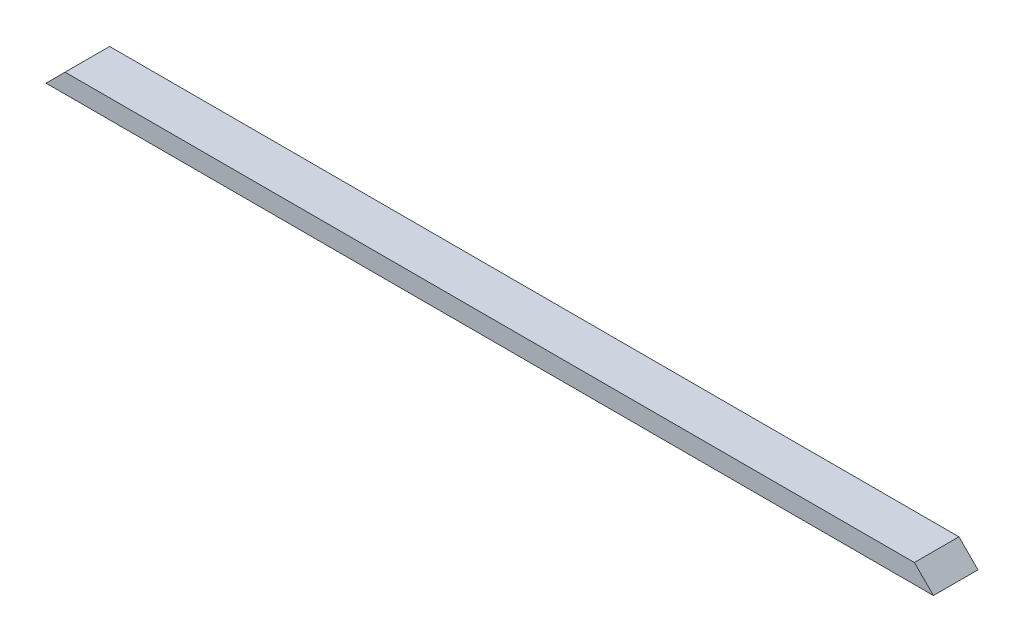
ISO-10303-21;
HEADER;
FILE_DESCRIPTION(('STEP AP214'),'2;1');
FILE_NAME('part.step','',(''),(''),'','','');
FILE_SCHEMA(('AUTOMOTIVE_DESIGN { 1 0 10303 214 1 1 1 1 }'));
ENDSEC;
DATA;
#1=APPLICATION_CONTEXT('core data for automotive mechanical design processes');
#2=APPLICATION_PROTOCOL_DEFINITION('international standard','automotive_design',2000,#1);
#3=PRODUCT_CONTEXT('',#1,'mechanical');
#4=PRODUCT('Part','Part','',(#3));
#5=PRODUCT_RELATED_PRODUCT_CATEGORY('part','',(#4));
#6=PRODUCT_DEFINITION_FORMATION('','',#4);
#7=PRODUCT_DEFINITION_CONTEXT('part definition',#1,'design');
#8=PRODUCT_DEFINITION('design','',#6,#7);
#9=PRODUCT_DEFINITION_SHAPE('','',#8);
#10=(LENGTH_UNIT() NAMED_UNIT(*) SI_UNIT(.MILLI.,.METRE.));
#11=(NAMED_UNIT(*) PLANE_ANGLE_UNIT() SI_UNIT($,.RADIAN.));
#12=(NAMED_UNIT(*) SI_UNIT($,.STERADIAN.) SOLID_ANGLE_UNIT());
#13=UNCERTAINTY_MEASURE_WITH_UNIT(LENGTH_MEASURE(1.E-05),#10,'distance_accuracy_value','');
#14=(GEOMETRIC_REPRESENTATION_CONTEXT(3) GLOBAL_UNCERTAINTY_ASSIGNED_CONTEXT((#13)) GLOBAL_UNIT_ASSIGNED_CONTEXT((#10,
#11,#12)) REPRESENTATION_CONTEXT('',''));
#15=CARTESIAN_POINT('',(0.,0.,0.));
#16=DIRECTION('',(0.,0.,1.));
#17=DIRECTION('',(1.,0.,0.));
#18=AXIS2_PLACEMENT_3D('',#15,#16,#17);
#19=CARTESIAN_POINT('',(0.,38.1,0.));
#20=DIRECTION('',(0.,0.,-1.));
#21=DIRECTION('',(-1.,0.,0.));
#22=AXIS2_PLACEMENT_3D('',#19,#20,#21);
#23=PLANE('',#22);
#24=DIRECTION('',(1.,0.,0.));
#25=VECTOR('',#24,1.);
#26=CARTESIAN_POINT('',(0.,38.1,0.));
#27=LINE('',#26,#25);
#28=CARTESIAN_POINT('',(38.1,38.1,0.));
#29=VERTEX_POINT('',#28);
#30=CARTESIAN_POINT('',(1733.55,38.1000000000001,0.));
#31=VERTEX_POINT('',#30);
#32=EDGE_CURVE('E46',#29,#31,#27,.T.);
#33=ORIENTED_EDGE('',*,*,#32,.F.);
#34=DIRECTION('',(0.707106781186547,0.707106781186547,0.));
#35=VECTOR('',#34,1.);
#36=CARTESIAN_POINT('',(0.,0.,0.));
#37=LINE('',#36,#35);
#38=CARTESIAN_POINT('',(0.,0.,0.));
#39=VERTEX_POINT('',#38);
#40=EDGE_CURVE('E81',#39,#29,#37,.T.);
#41=ORIENTED_EDGE('',*,*,#40,.F.);
#42=DIRECTION('',(1.,0.,0.));
#43=VECTOR('',#42,1.);
#44=CARTESIAN_POINT('',(0.,0.,0.));
#45=LINE('',#44,#43);
#46=CARTESIAN_POINT('',(1771.65,0.,0.));
#47=VERTEX_POINT('',#46);
#48=EDGE_CURVE('E86',#39,#47,#45,.T.);
#49=ORIENTED_EDGE('',*,*,#48,.T.);
#50=DIRECTION('',(0.707106781186547,-0.707106781186548,0.));
#51=VECTOR('',#50,1.);
#52=CARTESIAN_POINT('',(1733.55,38.1000000000001,0.));
#53=LINE('',#52,#51);
#54=EDGE_CURVE('E62',#31,#47,#53,.T.);
#55=ORIENTED_EDGE('',*,*,#54,.F.);
#56=EDGE_LOOP('',(#33,#41,#49,#55));
#57=FACE_BOUND('',#56,.T.);
#58=ADVANCED_FACE('F38',(#57),#23,.F.);
#59=CARTESIAN_POINT('',(0.,38.1,-88.9));
#60=DIRECTION('',(0.,0.,1.));
#61=DIRECTION('',(1.,0.,0.));
#62=AXIS2_PLACEMENT_3D('',#59,#60,#61);
#63=PLANE('',#62);
#64=DIRECTION('',(-1.,0.,0.));
#65=VECTOR('',#64,1.);
#66=CARTESIAN_POINT('',(0.,0.,-88.9));
#67=LINE('',#66,#65);
#68=CARTESIAN_POINT('',(1771.65,0.,-88.9));
#69=VERTEX_POINT('',#68);
#70=CARTESIAN_POINT('',(0.,0.,-88.9));
#71=VERTEX_POINT('',#70);
#72=EDGE_CURVE('E41',#69,#71,#67,.T.);
#73=ORIENTED_EDGE('',*,*,#72,.T.);
#74=DIRECTION('',(0.707106781186547,0.707106781186547,0.));
#75=VECTOR('',#74,1.);
#76=CARTESIAN_POINT('',(0.,0.,-88.9));
#77=LINE('',#76,#75);
#78=CARTESIAN_POINT('',(38.1,38.1,-88.9));
#79=VERTEX_POINT('',#78);
#80=EDGE_CURVE('E54',#71,#79,#77,.T.);
#81=ORIENTED_EDGE('',*,*,#80,.T.);
#82=DIRECTION('',(-1.,0.,0.));
#83=VECTOR('',#82,1.);
#84=CARTESIAN_POINT('',(0.,38.1,-88.9));
#85=LINE('',#84,#83);
#86=CARTESIAN_POINT('',(1733.55,38.1000000000001,-88.9));
#87=VERTEX_POINT('',#86);
#88=EDGE_CURVE('E11',#87,#79,#85,.T.);
#89=ORIENTED_EDGE('',*,*,#88,.F.);
#90=DIRECTION('',(0.707106781186547,-0.707106781186548,0.));
#91=VECTOR('',#90,1.);
#92=CARTESIAN_POINT('',(1733.55,38.1000000000001,-88.9));
#93=LINE('',#92,#91);
#94=EDGE_CURVE('E99',#87,#69,#93,.T.);
#95=ORIENTED_EDGE('',*,*,#94,.T.);
#96=EDGE_LOOP('',(#73,#81,#89,#95));
#97=FACE_BOUND('',#96,.T.);
#98=ADVANCED_FACE('F108',(#97),#63,.F.);
#99=CARTESIAN_POINT('',(0.,38.1,0.));
#100=DIRECTION('',(0.,-1.,0.));
#101=DIRECTION('',(0.,0.,-1.));
#102=AXIS2_PLACEMENT_3D('',#99,#100,#101);
#103=PLANE('',#102);
#104=ORIENTED_EDGE('',*,*,#88,.T.);
#105=DIRECTION('',(0.,0.,1.));
#106=VECTOR('',#105,1.);
#107=CARTESIAN_POINT('',(38.1,38.1,-88.9));
#108=LINE('',#107,#106);
#109=EDGE_CURVE('E87',#79,#29,#108,.T.);
#110=ORIENTED_EDGE('',*,*,#109,.T.);
#111=ORIENTED_EDGE('',*,*,#32,.T.);
#112=DIRECTION('',(0.,0.,1.));
#113=VECTOR('',#112,1.);
#114=CARTESIAN_POINT('',(1733.55,38.1000000000001,-88.9));
#115=LINE('',#114,#113);
#116=EDGE_CURVE('E102',#87,#31,#115,.T.);
#117=ORIENTED_EDGE('',*,*,#116,.F.);
#118=EDGE_LOOP('',(#104,#110,#111,#117));
#119=FACE_BOUND('',#118,.T.);
#120=ADVANCED_FACE('F111',(#119),#103,.F.);
#121=CARTESIAN_POINT('',(0.,0.,0.));
#122=DIRECTION('',(0.,-1.,0.));
#123=DIRECTION('',(0.,0.,-1.));
#124=AXIS2_PLACEMENT_3D('',#121,#122,#123);
#125=PLANE('',#124);
#126=DIRECTION('',(0.,0.,1.));
#127=VECTOR('',#126,1.);
#128=CARTESIAN_POINT('',(0.,0.,0.));
#129=LINE('',#128,#127);
#130=EDGE_CURVE('E78',#71,#39,#129,.T.);
#131=ORIENTED_EDGE('',*,*,#130,.F.);
#132=ORIENTED_EDGE('',*,*,#72,.F.);
#133=DIRECTION('',(0.,0.,-1.));
#134=VECTOR('',#133,1.);
#135=CARTESIAN_POINT('',(1771.65,0.,0.));
#136=LINE('',#135,#134);
#137=EDGE_CURVE('E95',#47,#69,#136,.T.);
#138=ORIENTED_EDGE('',*,*,#137,.F.);
#139=ORIENTED_EDGE('',*,*,#48,.F.);
#140=EDGE_LOOP('',(#131,#132,#138,#139));
#141=FACE_BOUND('',#140,.T.);
#142=ADVANCED_FACE('F94',(#141),#125,.T.);
#143=CARTESIAN_POINT('',(1733.55,38.1000000000001,-88.9));
#144=DIRECTION('',(-0.707106781186548,-0.707106781186547,0.));
#145=DIRECTION('',(0.707106781186547,-0.707106781186548,0.));
#146=AXIS2_PLACEMENT_3D('',#143,#144,#145);
#147=PLANE('',#146);
#148=ORIENTED_EDGE('',*,*,#54,.T.);
#149=ORIENTED_EDGE('',*,*,#137,.T.);
#150=ORIENTED_EDGE('',*,*,#94,.F.);
#151=ORIENTED_EDGE('',*,*,#116,.T.);
#152=EDGE_LOOP('',(#148,#149,#150,#151));
#153=FACE_BOUND('',#152,.T.);
#154=ADVANCED_FACE('F112',(#153),#147,.F.);
#155=CARTESIAN_POINT('',(0.,0.,-88.9));
#156=DIRECTION('',(0.707106781186547,-0.707106781186547,0.));
#157=DIRECTION('',(0.707106781186548,0.707106781186548,0.));
#158=AXIS2_PLACEMENT_3D('',#155,#156,#157);
#159=PLANE('',#158);
#160=ORIENTED_EDGE('',*,*,#40,.T.);
#161=ORIENTED_EDGE('',*,*,#109,.F.);
#162=ORIENTED_EDGE('',*,*,#80,.F.);
#163=ORIENTED_EDGE('',*,*,#130,.T.);
#164=EDGE_LOOP('',(#160,#161,#162,#163));
#165=FACE_BOUND('',#164,.T.);
#166=ADVANCED_FACE('F80',(#165),#159,.F.);
#167=CLOSED_SHELL('',(#58,#98,#120,#142,#154,#166));
#168=MANIFOLD_SOLID_BREP('B2',#167);
#169=ADVANCED_BREP_SHAPE_REPRESENTATION('',(#18,#168),#14);
#170=SHAPE_DEFINITION_REPRESENTATION(#9,#169);
ENDSEC;
END-ISO-10303-21;
